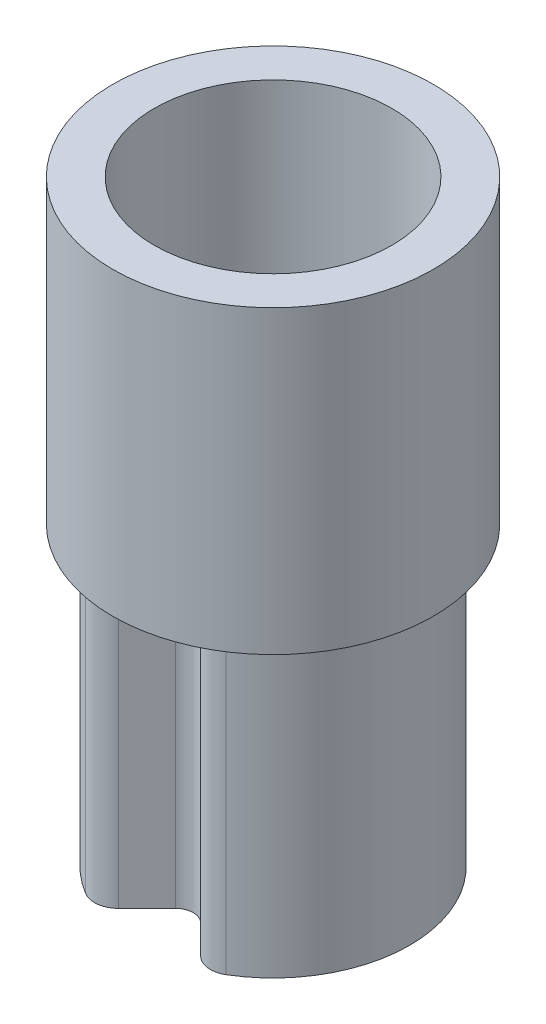
ISO-10303-21;
HEADER;
FILE_DESCRIPTION(('STEP AP214'),'2;1');
FILE_NAME('part.step','',(''),(''),'','','');
FILE_SCHEMA(('AUTOMOTIVE_DESIGN { 1 0 10303 214 1 1 1 1 }'));
ENDSEC;
DATA;
#1=APPLICATION_CONTEXT('core data for automotive mechanical design processes');
#2=APPLICATION_PROTOCOL_DEFINITION('international standard','automotive_design',2000,#1);
#3=PRODUCT_CONTEXT('',#1,'mechanical');
#4=PRODUCT('Part','Part','',(#3));
#5=PRODUCT_RELATED_PRODUCT_CATEGORY('part','',(#4));
#6=PRODUCT_DEFINITION_FORMATION('','',#4);
#7=PRODUCT_DEFINITION_CONTEXT('part definition',#1,'design');
#8=PRODUCT_DEFINITION('design','',#6,#7);
#9=PRODUCT_DEFINITION_SHAPE('','',#8);
#10=(LENGTH_UNIT() NAMED_UNIT(*) SI_UNIT(.MILLI.,.METRE.));
#11=(NAMED_UNIT(*) PLANE_ANGLE_UNIT() SI_UNIT($,.RADIAN.));
#12=(NAMED_UNIT(*) SI_UNIT($,.STERADIAN.) SOLID_ANGLE_UNIT());
#13=UNCERTAINTY_MEASURE_WITH_UNIT(LENGTH_MEASURE(1.E-05),#10,'distance_accuracy_value','');
#14=(GEOMETRIC_REPRESENTATION_CONTEXT(3) GLOBAL_UNCERTAINTY_ASSIGNED_CONTEXT((#13)) GLOBAL_UNIT_ASSIGNED_CONTEXT((#10,
#11,#12)) REPRESENTATION_CONTEXT('',''));
#15=CARTESIAN_POINT('',(0.,0.,0.));
#16=DIRECTION('',(0.,0.,1.));
#17=DIRECTION('',(1.,0.,0.));
#18=AXIS2_PLACEMENT_3D('',#15,#16,#17);
#19=CARTESIAN_POINT('',(0.,2.5,0.822132034355964));
#20=DIRECTION('',(0.,1.,0.));
#21=DIRECTION('',(0.,0.,1.));
#22=AXIS2_PLACEMENT_3D('',#19,#20,#21);
#23=PLANE('',#22);
#24=DIRECTION('',(0.707106781186548,0.,0.707106781186548));
#25=VECTOR('',#24,1.);
#26=CARTESIAN_POINT('',(0.106066017177983,2.5,0.716066017177983));
#27=LINE('',#26,#25);
#28=CARTESIAN_POINT('',(0.106066017177983,2.5,0.716066017177983));
#29=VERTEX_POINT('',#28);
#30=CARTESIAN_POINT('',(0.332945922473057,2.5,0.942945922473057));
#31=VERTEX_POINT('',#30);
#32=EDGE_CURVE('E154',#29,#31,#27,.T.);
#33=ORIENTED_EDGE('',*,*,#32,.T.);
#34=CARTESIAN_POINT('',(0.,2.5,0.));
#35=DIRECTION('',(0.,1.,0.));
#36=DIRECTION('',(0.,0.,1.));
#37=AXIS2_PLACEMENT_3D('',#34,#35,#36);
#38=CIRCLE('',#37,1.);
#39=CARTESIAN_POINT('',(0.513633561053512,2.5,0.858009653185492));
#40=VERTEX_POINT('',#39);
#41=EDGE_CURVE('E137',#31,#40,#38,.T.);
#42=ORIENTED_EDGE('',*,*,#41,.T.);
#43=CARTESIAN_POINT('',(0.487951883000837,2.5,0.815109170526217));
#44=DIRECTION('',(0.,1.,0.));
#45=DIRECTION('',(0.,0.,1.));
#46=AXIS2_PLACEMENT_3D('',#43,#44,#45);
#47=CIRCLE('',#46,0.05);
#48=CARTESIAN_POINT('',(0.452596543941509,2.5,0.850464509585545));
#49=VERTEX_POINT('',#48);
#50=EDGE_CURVE('E194',#40,#49,#47,.F.);
#51=ORIENTED_EDGE('',*,*,#50,.T.);
#52=DIRECTION('',(0.707106781186548,0.,0.707106781186547));
#53=VECTOR('',#52,1.);
#54=CARTESIAN_POINT('',(0.212132034355966,2.5,0.610000000000001));
#55=LINE('',#54,#53);
#56=CARTESIAN_POINT('',(0.212132034355966,2.5,0.610000000000002));
#57=VERTEX_POINT('',#56);
#58=EDGE_CURVE('E227',#57,#49,#55,.T.);
#59=ORIENTED_EDGE('',*,*,#58,.F.);
#60=CARTESIAN_POINT('',(0.,2.5,0.822132034355964));
#61=DIRECTION('',(0.,-1.,0.));
#62=DIRECTION('',(0.,0.,1.));
#63=AXIS2_PLACEMENT_3D('',#60,#61,#62);
#64=CIRCLE('',#63,0.3);
#65=CARTESIAN_POINT('',(-0.212132034355965,2.5,0.610000000000001));
#66=VERTEX_POINT('',#65);
#67=EDGE_CURVE('E223',#66,#57,#64,.T.);
#68=ORIENTED_EDGE('',*,*,#67,.F.);
#69=DIRECTION('',(0.707106781186547,0.,-0.707106781186548));
#70=VECTOR('',#69,1.);
#71=CARTESIAN_POINT('',(-0.479612456619358,2.5,0.877480422263394));
#72=LINE('',#71,#70);
#73=CARTESIAN_POINT('',(-0.452596543941509,2.5,0.850464509585545));
#74=VERTEX_POINT('',#73);
#75=EDGE_CURVE('E221',#74,#66,#72,.T.);
#76=ORIENTED_EDGE('',*,*,#75,.F.);
#77=CARTESIAN_POINT('',(-0.487951883000836,2.5,0.815109170526218));
#78=DIRECTION('',(0.,1.,0.));
#79=DIRECTION('',(0.,0.,1.));
#80=AXIS2_PLACEMENT_3D('',#77,#78,#79);
#81=CIRCLE('',#80,0.05);
#82=CARTESIAN_POINT('',(-0.513633561053512,2.5,0.858009653185492));
#83=VERTEX_POINT('',#82);
#84=EDGE_CURVE('E197',#74,#83,#81,.F.);
#85=ORIENTED_EDGE('',*,*,#84,.T.);
#86=CARTESIAN_POINT('',(-0.332945922473057,2.5,0.942945922473057));
#87=VERTEX_POINT('',#86);
#88=EDGE_CURVE('E12',#83,#87,#38,.T.);
#89=ORIENTED_EDGE('',*,*,#88,.T.);
#90=DIRECTION('',(0.707106781186547,0.,-0.707106781186548));
#91=VECTOR('',#90,1.);
#92=CARTESIAN_POINT('',(-0.448807004477936,2.5,1.05880700447794));
#93=LINE('',#92,#91);
#94=CARTESIAN_POINT('',(-0.106066017177983,2.5,0.716066017177983));
#95=VERTEX_POINT('',#94);
#96=EDGE_CURVE('E164',#87,#95,#93,.T.);
#97=ORIENTED_EDGE('',*,*,#96,.T.);
#98=CARTESIAN_POINT('',(0.,2.5,0.822132034355964));
#99=DIRECTION('',(0.,-1.,0.));
#100=DIRECTION('',(0.,0.,1.));
#101=AXIS2_PLACEMENT_3D('',#98,#99,#100);
#102=CIRCLE('',#101,0.15);
#103=EDGE_CURVE('E159',#95,#29,#102,.T.);
#104=ORIENTED_EDGE('',*,*,#103,.T.);
#105=EDGE_LOOP('',(#33,#42,#51,#59,#68,#76,#85,#89,#97,#104));
#106=FACE_BOUND('',#105,.T.);
#107=ADVANCED_FACE('F36',(#106),#23,.T.);
#108=CARTESIAN_POINT('',(0.,0.,0.822132034355964));
#109=DIRECTION('',(0.,1.,0.));
#110=DIRECTION('',(0.,0.,1.));
#111=AXIS2_PLACEMENT_3D('',#108,#109,#110);
#112=PLANE('',#111);
#113=CARTESIAN_POINT('',(0.,0.,0.));
#114=DIRECTION('',(0.,1.,0.));
#115=DIRECTION('',(0.,0.,1.));
#116=AXIS2_PLACEMENT_3D('',#113,#114,#115);
#117=CIRCLE('',#116,1.15);
#118=CARTESIAN_POINT('',(0.590678595211539,0.,0.986711101163316));
#119=VERTEX_POINT('',#118);
#120=CARTESIAN_POINT('',(-0.590678595211538,0.,0.986711101163316));
#121=VERTEX_POINT('',#120);
#122=EDGE_CURVE('E177',#119,#121,#117,.T.);
#123=ORIENTED_EDGE('',*,*,#122,.F.);
#124=CARTESIAN_POINT('',(0.487951883000836,0.,0.815109170526217));
#125=DIRECTION('',(0.,1.,0.));
#126=DIRECTION('',(0.,0.,1.));
#127=AXIS2_PLACEMENT_3D('',#124,#125,#126);
#128=CIRCLE('',#127,0.2);
#129=CARTESIAN_POINT('',(0.346530526763527,0.,0.956530526763527));
#130=VERTEX_POINT('',#129);
#131=EDGE_CURVE('E61',#119,#130,#128,.F.);
#132=ORIENTED_EDGE('',*,*,#131,.T.);
#133=DIRECTION('',(0.707106781186548,0.,0.707106781186548));
#134=VECTOR('',#133,1.);
#135=CARTESIAN_POINT('',(0.106066017177983,0.,0.716066017177983));
#136=LINE('',#135,#134);
#137=CARTESIAN_POINT('',(0.106066017177983,0.,0.716066017177983));
#138=VERTEX_POINT('',#137);
#139=EDGE_CURVE('E174',#138,#130,#136,.T.);
#140=ORIENTED_EDGE('',*,*,#139,.F.);
#141=CARTESIAN_POINT('',(0.,0.,0.822132034355964));
#142=DIRECTION('',(0.,-1.,0.));
#143=DIRECTION('',(0.,0.,1.));
#144=AXIS2_PLACEMENT_3D('',#141,#142,#143);
#145=CIRCLE('',#144,0.15);
#146=CARTESIAN_POINT('',(-0.106066017177983,0.,0.716066017177983));
#147=VERTEX_POINT('',#146);
#148=EDGE_CURVE('E171',#147,#138,#145,.T.);
#149=ORIENTED_EDGE('',*,*,#148,.F.);
#150=DIRECTION('',(0.707106781186547,0.,-0.707106781186548));
#151=VECTOR('',#150,1.);
#152=CARTESIAN_POINT('',(-0.448807004477936,0.,1.05880700447794));
#153=LINE('',#152,#151);
#154=CARTESIAN_POINT('',(-0.346530526763527,0.,0.956530526763527));
#155=VERTEX_POINT('',#154);
#156=EDGE_CURVE('E180',#155,#147,#153,.T.);
#157=ORIENTED_EDGE('',*,*,#156,.F.);
#158=CARTESIAN_POINT('',(-0.487951883000836,0.,0.815109170526218));
#159=DIRECTION('',(0.,1.,0.));
#160=DIRECTION('',(0.,0.,1.));
#161=AXIS2_PLACEMENT_3D('',#158,#159,#160);
#162=CIRCLE('',#161,0.2);
#163=EDGE_CURVE('E204',#155,#121,#162,.F.);
#164=ORIENTED_EDGE('',*,*,#163,.T.);
#165=EDGE_LOOP('',(#123,#132,#140,#149,#157,#164));
#166=FACE_BOUND('',#165,.T.);
#167=DIRECTION('',(0.707106781186548,0.,0.707106781186547));
#168=VECTOR('',#167,1.);
#169=CARTESIAN_POINT('',(0.212132034355966,0.,0.610000000000001));
#170=LINE('',#169,#168);
#171=CARTESIAN_POINT('',(0.212132034355966,0.,0.610000000000002));
#172=VERTEX_POINT('',#171);
#173=CARTESIAN_POINT('',(0.452596543941509,0.,0.850464509585545));
#174=VERTEX_POINT('',#173);
#175=EDGE_CURVE('E224',#172,#174,#170,.T.);
#176=ORIENTED_EDGE('',*,*,#175,.T.);
#177=CARTESIAN_POINT('',(0.487951883000837,0.,0.815109170526217));
#178=DIRECTION('',(0.,1.,0.));
#179=DIRECTION('',(0.,0.,1.));
#180=AXIS2_PLACEMENT_3D('',#177,#178,#179);
#181=CIRCLE('',#180,0.05);
#182=CARTESIAN_POINT('',(0.513633561053512,0.,0.858009653185492));
#183=VERTEX_POINT('',#182);
#184=EDGE_CURVE('E192',#174,#183,#181,.T.);
#185=ORIENTED_EDGE('',*,*,#184,.T.);
#186=CARTESIAN_POINT('',(0.,0.,0.));
#187=DIRECTION('',(0.,1.,0.));
#188=DIRECTION('',(0.,0.,1.));
#189=AXIS2_PLACEMENT_3D('',#186,#187,#188);
#190=CIRCLE('',#189,1.);
#191=CARTESIAN_POINT('',(-0.513633561053512,0.,0.858009653185492));
#192=VERTEX_POINT('',#191);
#193=EDGE_CURVE('E231',#183,#192,#190,.T.);
#194=ORIENTED_EDGE('',*,*,#193,.T.);
#195=CARTESIAN_POINT('',(-0.487951883000836,0.,0.815109170526218));
#196=DIRECTION('',(0.,1.,0.));
#197=DIRECTION('',(0.,0.,1.));
#198=AXIS2_PLACEMENT_3D('',#195,#196,#197);
#199=CIRCLE('',#198,0.05);
#200=CARTESIAN_POINT('',(-0.452596543941509,0.,0.850464509585545));
#201=VERTEX_POINT('',#200);
#202=EDGE_CURVE('E195',#192,#201,#199,.T.);
#203=ORIENTED_EDGE('',*,*,#202,.T.);
#204=DIRECTION('',(0.707106781186547,0.,-0.707106781186548));
#205=VECTOR('',#204,1.);
#206=CARTESIAN_POINT('',(-0.479612456619358,0.,0.877480422263394));
#207=LINE('',#206,#205);
#208=CARTESIAN_POINT('',(-0.212132034355965,0.,0.610000000000001));
#209=VERTEX_POINT('',#208);
#210=EDGE_CURVE('E234',#201,#209,#207,.T.);
#211=ORIENTED_EDGE('',*,*,#210,.T.);
#212=CARTESIAN_POINT('',(0.,0.,0.822132034355964));
#213=DIRECTION('',(0.,-1.,0.));
#214=DIRECTION('',(0.,0.,1.));
#215=AXIS2_PLACEMENT_3D('',#212,#213,#214);
#216=CIRCLE('',#215,0.3);
#217=EDGE_CURVE('E237',#209,#172,#216,.T.);
#218=ORIENTED_EDGE('',*,*,#217,.T.);
#219=EDGE_LOOP('',(#176,#185,#194,#203,#211,#218));
#220=FACE_BOUND('',#219,.T.);
#221=ADVANCED_FACE('F255',(#166,#220),#112,.F.);
#222=CARTESIAN_POINT('',(0.,2.5,0.822132034355964));
#223=DIRECTION('',(0.,-1.,0.));
#224=DIRECTION('',(0.,0.,-1.));
#225=AXIS2_PLACEMENT_3D('',#222,#223,#224);
#226=CYLINDRICAL_SURFACE('',#225,0.15);
#227=ORIENTED_EDGE('',*,*,#148,.T.);
#228=DIRECTION('',(0.,-1.,0.));
#229=VECTOR('',#228,1.);
#230=CARTESIAN_POINT('',(0.106066017177983,2.5,0.716066017177983));
#231=LINE('',#230,#229);
#232=EDGE_CURVE('E184',#29,#138,#231,.T.);
#233=ORIENTED_EDGE('',*,*,#232,.F.);
#234=ORIENTED_EDGE('',*,*,#103,.F.);
#235=DIRECTION('',(0.,-1.,0.));
#236=VECTOR('',#235,1.);
#237=CARTESIAN_POINT('',(-0.106066017177983,2.5,0.716066017177983));
#238=LINE('',#237,#236);
#239=EDGE_CURVE('E170',#95,#147,#238,.T.);
#240=ORIENTED_EDGE('',*,*,#239,.T.);
#241=EDGE_LOOP('',(#227,#233,#234,#240));
#242=FACE_BOUND('',#241,.T.);
#243=ADVANCED_FACE('F291',(#242),#226,.F.);
#244=CARTESIAN_POINT('',(0.106066017177983,2.5,0.716066017177983));
#245=DIRECTION('',(0.707106781186547,0.,-0.707106781186547));
#246=DIRECTION('',(-0.707106781186548,0.,-0.707106781186548));
#247=AXIS2_PLACEMENT_3D('',#244,#245,#246);
#248=PLANE('',#247);
#249=ORIENTED_EDGE('',*,*,#139,.T.);
#250=DIRECTION('',(0.,-1.,0.));
#251=VECTOR('',#250,1.);
#252=CARTESIAN_POINT('',(0.346530526763527,2.5,0.956530526763527));
#253=LINE('',#252,#251);
#254=CARTESIAN_POINT('',(0.346530526763527,2.5,0.956530526763527));
#255=VERTEX_POINT('',#254);
#256=EDGE_CURVE('E157',#130,#255,#253,.F.);
#257=ORIENTED_EDGE('',*,*,#256,.T.);
#258=EDGE_CURVE('E133',#31,#255,#27,.T.);
#259=ORIENTED_EDGE('',*,*,#258,.F.);
#260=ORIENTED_EDGE('',*,*,#32,.F.);
#261=ORIENTED_EDGE('',*,*,#232,.T.);
#262=EDGE_LOOP('',(#249,#257,#259,#260,#261));
#263=FACE_BOUND('',#262,.T.);
#264=ADVANCED_FACE('F152',(#263),#248,.F.);
#265=CARTESIAN_POINT('',(0.,2.5,0.));
#266=DIRECTION('',(0.,-1.,0.));
#267=DIRECTION('',(0.,0.,-1.));
#268=AXIS2_PLACEMENT_3D('',#265,#266,#267);
#269=CYLINDRICAL_SURFACE('',#268,1.15);
#270=CARTESIAN_POINT('',(0.,2.5,0.));
#271=DIRECTION('',(0.,1.,0.));
#272=DIRECTION('',(0.,0.,1.));
#273=AXIS2_PLACEMENT_3D('',#270,#271,#272);
#274=CIRCLE('',#273,1.15);
#275=CARTESIAN_POINT('',(0.590678595211539,2.5,0.986711101163316));
#276=VERTEX_POINT('',#275);
#277=CARTESIAN_POINT('',(-0.590678595211538,2.5,0.986711101163316));
#278=VERTEX_POINT('',#277);
#279=EDGE_CURVE('E163',#276,#278,#274,.T.);
#280=ORIENTED_EDGE('',*,*,#279,.F.);
#281=DIRECTION('',(0.,-1.,0.));
#282=VECTOR('',#281,1.);
#283=CARTESIAN_POINT('',(0.590678595211539,2.5,0.986711101163316));
#284=LINE('',#283,#282);
#285=EDGE_CURVE('E201',#276,#119,#284,.T.);
#286=ORIENTED_EDGE('',*,*,#285,.T.);
#287=ORIENTED_EDGE('',*,*,#122,.T.);
#288=DIRECTION('',(0.,-1.,0.));
#289=VECTOR('',#288,1.);
#290=CARTESIAN_POINT('',(-0.590678595211539,2.5,0.986711101163316));
#291=LINE('',#290,#289);
#292=EDGE_CURVE('E198',#121,#278,#291,.F.);
#293=ORIENTED_EDGE('',*,*,#292,.T.);
#294=EDGE_LOOP('',(#280,#286,#287,#293));
#295=FACE_BOUND('',#294,.T.);
#296=ADVANCED_FACE('F299',(#295),#269,.T.);
#297=CARTESIAN_POINT('',(-0.448807004477936,2.5,1.05880700447794));
#298=DIRECTION('',(-0.707106781186548,0.,-0.707106781186547));
#299=DIRECTION('',(-0.707106781186547,0.,0.707106781186548));
#300=AXIS2_PLACEMENT_3D('',#297,#298,#299);
#301=PLANE('',#300);
#302=CARTESIAN_POINT('',(-0.346530526763527,2.5,0.956530526763527));
#303=VERTEX_POINT('',#302);
#304=EDGE_CURVE('E136',#303,#87,#93,.T.);
#305=ORIENTED_EDGE('',*,*,#304,.F.);
#306=DIRECTION('',(0.,-1.,0.));
#307=VECTOR('',#306,1.);
#308=CARTESIAN_POINT('',(-0.346530526763527,2.5,0.956530526763527));
#309=LINE('',#308,#307);
#310=EDGE_CURVE('E45',#303,#155,#309,.T.);
#311=ORIENTED_EDGE('',*,*,#310,.T.);
#312=ORIENTED_EDGE('',*,*,#156,.T.);
#313=ORIENTED_EDGE('',*,*,#239,.F.);
#314=ORIENTED_EDGE('',*,*,#96,.F.);
#315=EDGE_LOOP('',(#305,#311,#312,#313,#314));
#316=FACE_BOUND('',#315,.T.);
#317=ADVANCED_FACE('F296',(#316),#301,.F.);
#318=CARTESIAN_POINT('',(0.,2.5,0.));
#319=DIRECTION('',(0.,-1.,0.));
#320=DIRECTION('',(0.,0.,-1.));
#321=AXIS2_PLACEMENT_3D('',#318,#319,#320);
#322=CYLINDRICAL_SURFACE('',#321,1.);
#323=ORIENTED_EDGE('',*,*,#193,.F.);
#324=DIRECTION('',(0.,-1.,0.));
#325=VECTOR('',#324,1.);
#326=CARTESIAN_POINT('',(0.513633561053512,2.5,0.858009653185492));
#327=LINE('',#326,#325);
#328=EDGE_CURVE('E145',#183,#40,#327,.F.);
#329=ORIENTED_EDGE('',*,*,#328,.T.);
#330=ORIENTED_EDGE('',*,*,#41,.F.);
#331=EDGE_CURVE('E53',#87,#31,#38,.T.);
#332=ORIENTED_EDGE('',*,*,#331,.F.);
#333=ORIENTED_EDGE('',*,*,#88,.F.);
#334=DIRECTION('',(0.,-1.,0.));
#335=VECTOR('',#334,1.);
#336=CARTESIAN_POINT('',(-0.513633561053512,2.5,0.858009653185492));
#337=LINE('',#336,#335);
#338=EDGE_CURVE('E189',#83,#192,#337,.T.);
#339=ORIENTED_EDGE('',*,*,#338,.T.);
#340=EDGE_LOOP('',(#323,#329,#330,#332,#333,#339));
#341=FACE_BOUND('',#340,.T.);
#342=CARTESIAN_POINT('',(0.,5.03,0.));
#343=DIRECTION('',(0.,1.,0.));
#344=DIRECTION('',(0.,0.,1.));
#345=AXIS2_PLACEMENT_3D('',#342,#343,#344);
#346=CIRCLE('',#345,1.);
#347=CARTESIAN_POINT('',(0.,5.03,1.));
#348=VERTEX_POINT('',#347);
#349=EDGE_CURVE('E138',#348,#348,#346,.T.);
#350=ORIENTED_EDGE('',*,*,#349,.T.);
#351=EDGE_LOOP('',(#350));
#352=FACE_BOUND('',#351,.T.);
#353=ADVANCED_FACE('F142',(#341,#352),#322,.F.);
#354=CARTESIAN_POINT('',(-0.479612456619358,2.5,0.877480422263394));
#355=DIRECTION('',(-0.707106781186548,0.,-0.707106781186547));
#356=DIRECTION('',(-0.707106781186547,0.,0.707106781186548));
#357=AXIS2_PLACEMENT_3D('',#354,#355,#356);
#358=PLANE('',#357);
#359=ORIENTED_EDGE('',*,*,#210,.F.);
#360=DIRECTION('',(0.,1.,0.));
#361=VECTOR('',#360,1.);
#362=CARTESIAN_POINT('',(-0.452596543941509,2.5,0.850464509585545));
#363=LINE('',#362,#361);
#364=EDGE_CURVE('E190',#201,#74,#363,.T.);
#365=ORIENTED_EDGE('',*,*,#364,.T.);
#366=ORIENTED_EDGE('',*,*,#75,.T.);
#367=DIRECTION('',(0.,-1.,0.));
#368=VECTOR('',#367,1.);
#369=CARTESIAN_POINT('',(-0.212132034355965,2.5,0.610000000000001));
#370=LINE('',#369,#368);
#371=EDGE_CURVE('E175',#66,#209,#370,.T.);
#372=ORIENTED_EDGE('',*,*,#371,.T.);
#373=EDGE_LOOP('',(#359,#365,#366,#372));
#374=FACE_BOUND('',#373,.T.);
#375=ADVANCED_FACE('F247',(#374),#358,.T.);
#376=CARTESIAN_POINT('',(0.,2.5,0.822132034355964));
#377=DIRECTION('',(0.,-1.,0.));
#378=DIRECTION('',(0.,0.,-1.));
#379=AXIS2_PLACEMENT_3D('',#376,#377,#378);
#380=CYLINDRICAL_SURFACE('',#379,0.3);
#381=ORIENTED_EDGE('',*,*,#217,.F.);
#382=ORIENTED_EDGE('',*,*,#371,.F.);
#383=ORIENTED_EDGE('',*,*,#67,.T.);
#384=DIRECTION('',(0.,-1.,0.));
#385=VECTOR('',#384,1.);
#386=CARTESIAN_POINT('',(0.212132034355966,2.5,0.610000000000002));
#387=LINE('',#386,#385);
#388=EDGE_CURVE('E230',#57,#172,#387,.T.);
#389=ORIENTED_EDGE('',*,*,#388,.T.);
#390=EDGE_LOOP('',(#381,#382,#383,#389));
#391=FACE_BOUND('',#390,.T.);
#392=ADVANCED_FACE('F252',(#391),#380,.T.);
#393=CARTESIAN_POINT('',(0.212132034355966,2.5,0.610000000000001));
#394=DIRECTION('',(0.707106781186547,0.,-0.707106781186548));
#395=DIRECTION('',(-0.707106781186548,0.,-0.707106781186547));
#396=AXIS2_PLACEMENT_3D('',#393,#394,#395);
#397=PLANE('',#396);
#398=ORIENTED_EDGE('',*,*,#58,.T.);
#399=DIRECTION('',(0.,1.,0.));
#400=VECTOR('',#399,1.);
#401=CARTESIAN_POINT('',(0.452596543941509,0.,0.850464509585545));
#402=LINE('',#401,#400);
#403=EDGE_CURVE('E186',#49,#174,#402,.F.);
#404=ORIENTED_EDGE('',*,*,#403,.T.);
#405=ORIENTED_EDGE('',*,*,#175,.F.);
#406=ORIENTED_EDGE('',*,*,#388,.F.);
#407=EDGE_LOOP('',(#398,#404,#405,#406));
#408=FACE_BOUND('',#407,.T.);
#409=ADVANCED_FACE('F274',(#408),#397,.T.);
#410=CARTESIAN_POINT('',(0.487951883000837,2.5,0.815109170526217));
#411=DIRECTION('',(0.,-1.,0.));
#412=DIRECTION('',(0.,0.,-1.));
#413=AXIS2_PLACEMENT_3D('',#410,#411,#412);
#414=CYLINDRICAL_SURFACE('',#413,0.05);
#415=ORIENTED_EDGE('',*,*,#50,.F.);
#416=ORIENTED_EDGE('',*,*,#328,.F.);
#417=ORIENTED_EDGE('',*,*,#184,.F.);
#418=ORIENTED_EDGE('',*,*,#403,.F.);
#419=EDGE_LOOP('',(#415,#416,#417,#418));
#420=FACE_BOUND('',#419,.T.);
#421=ADVANCED_FACE('F275',(#420),#414,.F.);
#422=CARTESIAN_POINT('',(-0.487951883000836,2.5,0.815109170526218));
#423=DIRECTION('',(0.,-1.,0.));
#424=DIRECTION('',(0.,0.,-1.));
#425=AXIS2_PLACEMENT_3D('',#422,#423,#424);
#426=CYLINDRICAL_SURFACE('',#425,0.05);
#427=ORIENTED_EDGE('',*,*,#84,.F.);
#428=ORIENTED_EDGE('',*,*,#364,.F.);
#429=ORIENTED_EDGE('',*,*,#202,.F.);
#430=ORIENTED_EDGE('',*,*,#338,.F.);
#431=EDGE_LOOP('',(#427,#428,#429,#430));
#432=FACE_BOUND('',#431,.T.);
#433=ADVANCED_FACE('F260',(#432),#426,.F.);
#434=CARTESIAN_POINT('',(0.487951883000836,2.5,0.815109170526217));
#435=DIRECTION('',(0.,-1.,0.));
#436=DIRECTION('',(0.,0.,-1.));
#437=AXIS2_PLACEMENT_3D('',#434,#435,#436);
#438=CYLINDRICAL_SURFACE('',#437,0.2);
#439=CARTESIAN_POINT('',(0.487951883000836,2.5,0.815109170526217));
#440=DIRECTION('',(0.,1.,0.));
#441=DIRECTION('',(0.,0.,1.));
#442=AXIS2_PLACEMENT_3D('',#439,#440,#441);
#443=CIRCLE('',#442,0.2);
#444=EDGE_CURVE('E210',#255,#276,#443,.T.);
#445=ORIENTED_EDGE('',*,*,#444,.F.);
#446=ORIENTED_EDGE('',*,*,#256,.F.);
#447=ORIENTED_EDGE('',*,*,#131,.F.);
#448=ORIENTED_EDGE('',*,*,#285,.F.);
#449=EDGE_LOOP('',(#445,#446,#447,#448));
#450=FACE_BOUND('',#449,.T.);
#451=ADVANCED_FACE('F282',(#450),#438,.T.);
#452=CARTESIAN_POINT('',(-0.487951883000836,2.5,0.815109170526218));
#453=DIRECTION('',(0.,-1.,0.));
#454=DIRECTION('',(0.,0.,-1.));
#455=AXIS2_PLACEMENT_3D('',#452,#453,#454);
#456=CYLINDRICAL_SURFACE('',#455,0.2);
#457=CARTESIAN_POINT('',(-0.487951883000836,2.5,0.815109170526218));
#458=DIRECTION('',(0.,1.,0.));
#459=DIRECTION('',(0.,0.,1.));
#460=AXIS2_PLACEMENT_3D('',#457,#458,#459);
#461=CIRCLE('',#460,0.2);
#462=EDGE_CURVE('E208',#278,#303,#461,.T.);
#463=ORIENTED_EDGE('',*,*,#462,.F.);
#464=ORIENTED_EDGE('',*,*,#292,.F.);
#465=ORIENTED_EDGE('',*,*,#163,.F.);
#466=ORIENTED_EDGE('',*,*,#310,.F.);
#467=EDGE_LOOP('',(#463,#464,#465,#466));
#468=FACE_BOUND('',#467,.T.);
#469=ADVANCED_FACE('F38',(#468),#456,.T.);
#470=CARTESIAN_POINT('',(0.,2.5,0.));
#471=DIRECTION('',(0.,1.,0.));
#472=DIRECTION('',(0.,0.,1.));
#473=AXIS2_PLACEMENT_3D('',#470,#471,#472);
#474=PLANE('',#473);
#475=CARTESIAN_POINT('',(0.,2.5,0.));
#476=DIRECTION('',(0.,1.,0.));
#477=DIRECTION('',(0.,0.,1.));
#478=AXIS2_PLACEMENT_3D('',#475,#476,#477);
#479=CIRCLE('',#478,1.35);
#480=CARTESIAN_POINT('',(0.,2.5,1.35));
#481=VERTEX_POINT('',#480);
#482=EDGE_CURVE('E149',#481,#481,#479,.T.);
#483=ORIENTED_EDGE('',*,*,#482,.F.);
#484=EDGE_LOOP('',(#483));
#485=FACE_BOUND('',#484,.T.);
#486=ORIENTED_EDGE('',*,*,#331,.T.);
#487=ORIENTED_EDGE('',*,*,#258,.T.);
#488=ORIENTED_EDGE('',*,*,#444,.T.);
#489=ORIENTED_EDGE('',*,*,#279,.T.);
#490=ORIENTED_EDGE('',*,*,#462,.T.);
#491=ORIENTED_EDGE('',*,*,#304,.T.);
#492=EDGE_LOOP('',(#486,#487,#488,#489,#490,#491));
#493=FACE_BOUND('',#492,.T.);
#494=ADVANCED_FACE('F131',(#485,#493),#474,.F.);
#495=CARTESIAN_POINT('',(0.,13.8783766184074,0.));
#496=DIRECTION('',(0.,-1.,0.));
#497=DIRECTION('',(0.,0.,-1.));
#498=AXIS2_PLACEMENT_3D('',#495,#496,#497);
#499=CYLINDRICAL_SURFACE('',#498,1.35);
#500=ORIENTED_EDGE('',*,*,#482,.T.);
#501=EDGE_LOOP('',(#500));
#502=FACE_BOUND('',#501,.T.);
#503=CARTESIAN_POINT('',(0.,5.03,0.));
#504=DIRECTION('',(0.,1.,0.));
#505=DIRECTION('',(0.,0.,1.));
#506=AXIS2_PLACEMENT_3D('',#503,#504,#505);
#507=CIRCLE('',#506,1.35);
#508=CARTESIAN_POINT('',(0.,5.03,1.35));
#509=VERTEX_POINT('',#508);
#510=EDGE_CURVE('E235',#509,#509,#507,.T.);
#511=ORIENTED_EDGE('',*,*,#510,.F.);
#512=EDGE_LOOP('',(#511));
#513=FACE_BOUND('',#512,.T.);
#514=ADVANCED_FACE('F325',(#502,#513),#499,.T.);
#515=CARTESIAN_POINT('',(0.,5.03,0.822132034355964));
#516=DIRECTION('',(0.,1.,0.));
#517=DIRECTION('',(0.,0.,1.));
#518=AXIS2_PLACEMENT_3D('',#515,#516,#517);
#519=PLANE('',#518);
#520=ORIENTED_EDGE('',*,*,#349,.F.);
#521=EDGE_LOOP('',(#520));
#522=FACE_BOUND('',#521,.T.);
#523=ORIENTED_EDGE('',*,*,#510,.T.);
#524=EDGE_LOOP('',(#523));
#525=FACE_BOUND('',#524,.T.);
#526=ADVANCED_FACE('F407',(#522,#525),#519,.T.);
#527=CLOSED_SHELL('',(#107,#221,#243,#264,#296,#317,#353,#375,#392,#409,#421,#433,#451,#469,
#494,#514,#526));
#528=MANIFOLD_SOLID_BREP('B2',#527);
#529=ADVANCED_BREP_SHAPE_REPRESENTATION('',(#18,#528),#14);
#530=SHAPE_DEFINITION_REPRESENTATION(#9,#529);
ENDSEC;
END-ISO-10303-21;
